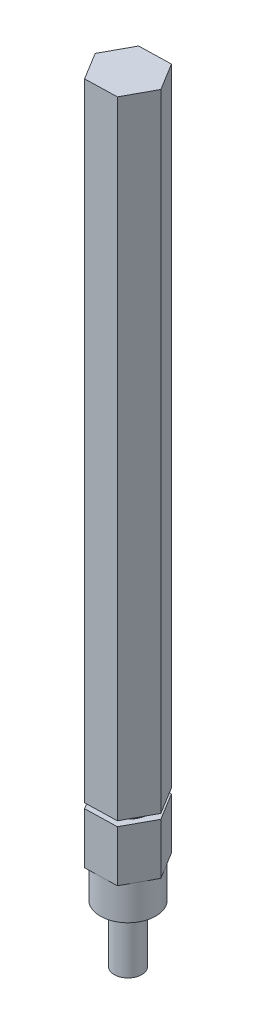
ISO-10303-21;
HEADER;
FILE_DESCRIPTION(('STEP AP214'),'2;1');
FILE_NAME('part.step','',(''),(''),'','','');
FILE_SCHEMA(('AUTOMOTIVE_DESIGN { 1 0 10303 214 1 1 1 1 }'));
ENDSEC;
DATA;
#1=APPLICATION_CONTEXT('core data for automotive mechanical design processes');
#2=APPLICATION_PROTOCOL_DEFINITION('international standard','automotive_design',2000,#1);
#3=PRODUCT_CONTEXT('',#1,'mechanical');
#4=PRODUCT('Part','Part','',(#3));
#5=PRODUCT_RELATED_PRODUCT_CATEGORY('part','',(#4));
#6=PRODUCT_DEFINITION_FORMATION('','',#4);
#7=PRODUCT_DEFINITION_CONTEXT('part definition',#1,'design');
#8=PRODUCT_DEFINITION('design','',#6,#7);
#9=PRODUCT_DEFINITION_SHAPE('','',#8);
#10=(LENGTH_UNIT() NAMED_UNIT(*) SI_UNIT(.MILLI.,.METRE.));
#11=(NAMED_UNIT(*) PLANE_ANGLE_UNIT() SI_UNIT($,.RADIAN.));
#12=(NAMED_UNIT(*) SI_UNIT($,.STERADIAN.) SOLID_ANGLE_UNIT());
#13=UNCERTAINTY_MEASURE_WITH_UNIT(LENGTH_MEASURE(1.E-05),#10,'distance_accuracy_value','');
#14=(GEOMETRIC_REPRESENTATION_CONTEXT(3) GLOBAL_UNCERTAINTY_ASSIGNED_CONTEXT((#13)) GLOBAL_UNIT_ASSIGNED_CONTEXT((#10,
#11,#12)) REPRESENTATION_CONTEXT('',''));
#15=CARTESIAN_POINT('',(0.,0.,0.));
#16=DIRECTION('',(0.,0.,1.));
#17=DIRECTION('',(1.,0.,0.));
#18=AXIS2_PLACEMENT_3D('',#15,#16,#17);
#19=CARTESIAN_POINT('',(0.,13.208,0.));
#20=DIRECTION('',(0.,-1.,0.));
#21=DIRECTION('',(0.,0.,-1.));
#22=AXIS2_PLACEMENT_3D('',#19,#20,#21);
#23=CYLINDRICAL_SURFACE('',#22,3.1496);
#24=CARTESIAN_POINT('',(0.,13.208,0.));
#25=DIRECTION('',(0.,1.,0.));
#26=DIRECTION('',(0.,0.,1.));
#27=AXIS2_PLACEMENT_3D('',#24,#25,#26);
#28=CIRCLE('',#27,3.1496);
#29=CARTESIAN_POINT('',(0.,13.208,3.1496));
#30=VERTEX_POINT('',#29);
#31=EDGE_CURVE('E11',#30,#30,#28,.T.);
#32=ORIENTED_EDGE('',*,*,#31,.F.);
#33=EDGE_LOOP('',(#32));
#34=FACE_BOUND('',#33,.T.);
#35=CARTESIAN_POINT('',(0.,0.,0.));
#36=DIRECTION('',(0.,1.,0.));
#37=DIRECTION('',(0.,0.,1.));
#38=AXIS2_PLACEMENT_3D('',#35,#36,#37);
#39=CIRCLE('',#38,3.1496);
#40=CARTESIAN_POINT('',(0.,0.,3.1496));
#41=VERTEX_POINT('',#40);
#42=EDGE_CURVE('E38',#41,#41,#39,.T.);
#43=ORIENTED_EDGE('',*,*,#42,.T.);
#44=EDGE_LOOP('',(#43));
#45=FACE_BOUND('',#44,.T.);
#46=ADVANCED_FACE('F35',(#34,#45),#23,.T.);
#47=CARTESIAN_POINT('',(0.,0.,0.));
#48=DIRECTION('',(0.,1.,0.));
#49=DIRECTION('',(0.,0.,1.));
#50=AXIS2_PLACEMENT_3D('',#47,#48,#49);
#51=PLANE('',#50);
#52=ORIENTED_EDGE('',*,*,#42,.F.);
#53=EDGE_LOOP('',(#52));
#54=FACE_BOUND('',#53,.T.);
#55=ADVANCED_FACE('F274',(#54),#51,.F.);
#56=CARTESIAN_POINT('',(0.,21.0947,0.));
#57=DIRECTION('',(0.,-1.,0.));
#58=DIRECTION('',(0.,0.,-1.));
#59=AXIS2_PLACEMENT_3D('',#56,#57,#58);
#60=CYLINDRICAL_SURFACE('',#59,6.35);
#61=CARTESIAN_POINT('',(0.,21.0947,0.));
#62=DIRECTION('',(0.,1.,0.));
#63=DIRECTION('',(0.,0.,1.));
#64=AXIS2_PLACEMENT_3D('',#61,#62,#63);
#65=CIRCLE('',#64,6.35);
#66=CARTESIAN_POINT('',(0.16365762984017,21.0947,6.34789068747998));
#67=VERTEX_POINT('',#66);
#68=CARTESIAN_POINT('',(5.57926341072441,21.0947,3.03221367877525));
#69=VERTEX_POINT('',#68);
#70=EDGE_CURVE('E231',#67,#69,#65,.T.);
#71=ORIENTED_EDGE('',*,*,#70,.F.);
#72=CARTESIAN_POINT('',(-5.41560578088425,21.0947,3.31567700870473));
#73=VERTEX_POINT('',#72);
#74=EDGE_CURVE('E49',#73,#67,#65,.T.);
#75=ORIENTED_EDGE('',*,*,#74,.F.);
#76=CARTESIAN_POINT('',(-5.57926341072442,21.0947,-3.03221367877526));
#77=VERTEX_POINT('',#76);
#78=EDGE_CURVE('E53',#77,#73,#65,.T.);
#79=ORIENTED_EDGE('',*,*,#78,.F.);
#80=CARTESIAN_POINT('',(-0.163657629840172,21.0947,-6.34789068747999));
#81=VERTEX_POINT('',#80);
#82=EDGE_CURVE('E242',#81,#77,#65,.T.);
#83=ORIENTED_EDGE('',*,*,#82,.F.);
#84=CARTESIAN_POINT('',(5.41560578088425,21.0947,-3.31567700870473));
#85=VERTEX_POINT('',#84);
#86=EDGE_CURVE('E246',#85,#81,#65,.T.);
#87=ORIENTED_EDGE('',*,*,#86,.F.);
#88=EDGE_CURVE('E234',#69,#85,#65,.T.);
#89=ORIENTED_EDGE('',*,*,#88,.F.);
#90=EDGE_LOOP('',(#71,#75,#79,#83,#87,#89));
#91=FACE_BOUND('',#90,.T.);
#92=CARTESIAN_POINT('',(0.,13.208,0.));
#93=DIRECTION('',(0.,1.,0.));
#94=DIRECTION('',(0.,0.,1.));
#95=AXIS2_PLACEMENT_3D('',#92,#93,#94);
#96=CIRCLE('',#95,6.35);
#97=CARTESIAN_POINT('',(0.,13.208,6.35));
#98=VERTEX_POINT('',#97);
#99=EDGE_CURVE('E230',#98,#98,#96,.T.);
#100=ORIENTED_EDGE('',*,*,#99,.T.);
#101=EDGE_LOOP('',(#100));
#102=FACE_BOUND('',#101,.T.);
#103=ADVANCED_FACE('F271',(#91,#102),#60,.T.);
#104=CARTESIAN_POINT('',(0.,13.208,0.));
#105=DIRECTION('',(0.,1.,0.));
#106=DIRECTION('',(0.,0.,1.));
#107=AXIS2_PLACEMENT_3D('',#104,#105,#106);
#108=PLANE('',#107);
#109=ORIENTED_EDGE('',*,*,#31,.T.);
#110=EDGE_LOOP('',(#109));
#111=FACE_BOUND('',#110,.T.);
#112=ORIENTED_EDGE('',*,*,#99,.F.);
#113=EDGE_LOOP('',(#112));
#114=FACE_BOUND('',#113,.T.);
#115=ADVANCED_FACE('F273',(#111,#114),#108,.F.);
#116=CARTESIAN_POINT('',(0.,21.0947,0.));
#117=DIRECTION('',(0.,1.,0.));
#118=DIRECTION('',(0.,0.,1.));
#119=AXIS2_PLACEMENT_3D('',#116,#117,#118);
#120=PLANE('',#119);
#121=DIRECTION('',(0.999667824799997,0.,-0.0257728550929402));
#122=VECTOR('',#121,1.);
#123=CARTESIAN_POINT('',(-3.50129876736272,21.0947,6.44237846412314));
#124=LINE('',#123,#122);
#125=CARTESIAN_POINT('',(3.82861402704306,21.0947,6.25340291083682));
#126=VERTEX_POINT('',#125);
#127=EDGE_CURVE('E174',#67,#126,#124,.T.);
#128=ORIENTED_EDGE('',*,*,#127,.F.);
#129=ORIENTED_EDGE('',*,*,#70,.T.);
#130=DIRECTION('',(0.477513965161457,0.,-0.878624159169199));
#131=VECTOR('',#130,1.);
#132=CARTESIAN_POINT('',(3.82861402704306,21.0947,6.25340291083682));
#133=LINE('',#132,#131);
#134=EDGE_CURVE('E195',#126,#69,#133,.T.);
#135=ORIENTED_EDGE('',*,*,#134,.F.);
#136=EDGE_LOOP('',(#128,#129,#135));
#137=FACE_BOUND('',#136,.T.);
#138=ADVANCED_FACE('F270',(#137),#120,.F.);
#139=CARTESIAN_POINT('',(7.32991279440578,21.0947,-0.188975553286322));
#140=VERTEX_POINT('',#139);
#141=EDGE_CURVE('E194',#69,#140,#133,.T.);
#142=ORIENTED_EDGE('',*,*,#141,.F.);
#143=ORIENTED_EDGE('',*,*,#88,.T.);
#144=DIRECTION('',(-0.52215385963854,0.,-0.852851304076259));
#145=VECTOR('',#144,1.);
#146=CARTESIAN_POINT('',(7.32991279440578,21.0947,-0.188975553286322));
#147=LINE('',#146,#145);
#148=EDGE_CURVE('E199',#140,#85,#147,.T.);
#149=ORIENTED_EDGE('',*,*,#148,.F.);
#150=EDGE_LOOP('',(#142,#143,#149));
#151=FACE_BOUND('',#150,.T.);
#152=ADVANCED_FACE('F258',(#151),#120,.F.);
#153=CARTESIAN_POINT('',(3.50129876736272,21.0947,-6.44237846412315));
#154=VERTEX_POINT('',#153);
#155=EDGE_CURVE('E198',#85,#154,#147,.T.);
#156=ORIENTED_EDGE('',*,*,#155,.F.);
#157=ORIENTED_EDGE('',*,*,#86,.T.);
#158=DIRECTION('',(-0.999667824799997,0.,0.0257728550929404));
#159=VECTOR('',#158,1.);
#160=CARTESIAN_POINT('',(3.50129876736272,21.0947,-6.44237846412315));
#161=LINE('',#160,#159);
#162=EDGE_CURVE('E203',#154,#81,#161,.T.);
#163=ORIENTED_EDGE('',*,*,#162,.F.);
#164=EDGE_LOOP('',(#156,#157,#163));
#165=FACE_BOUND('',#164,.T.);
#166=ADVANCED_FACE('F259',(#165),#120,.F.);
#167=CARTESIAN_POINT('',(-3.82861402704306,21.0947,-6.25340291083683));
#168=VERTEX_POINT('',#167);
#169=EDGE_CURVE('E202',#81,#168,#161,.T.);
#170=ORIENTED_EDGE('',*,*,#169,.F.);
#171=ORIENTED_EDGE('',*,*,#82,.T.);
#172=DIRECTION('',(-0.477513965161458,0.,0.878624159169199));
#173=VECTOR('',#172,1.);
#174=CARTESIAN_POINT('',(-3.82861402704306,21.0947,-6.25340291083683));
#175=LINE('',#174,#173);
#176=EDGE_CURVE('E207',#168,#77,#175,.T.);
#177=ORIENTED_EDGE('',*,*,#176,.F.);
#178=EDGE_LOOP('',(#170,#171,#177));
#179=FACE_BOUND('',#178,.T.);
#180=ADVANCED_FACE('F331',(#179),#120,.F.);
#181=CARTESIAN_POINT('',(-7.32991279440578,21.0947,0.188975553286315));
#182=VERTEX_POINT('',#181);
#183=EDGE_CURVE('E206',#77,#182,#175,.T.);
#184=ORIENTED_EDGE('',*,*,#183,.F.);
#185=ORIENTED_EDGE('',*,*,#78,.T.);
#186=DIRECTION('',(0.52215385963854,0.,0.852851304076259));
#187=VECTOR('',#186,1.);
#188=CARTESIAN_POINT('',(-7.32991279440578,21.0947,0.188975553286315));
#189=LINE('',#188,#187);
#190=EDGE_CURVE('E180',#182,#73,#189,.T.);
#191=ORIENTED_EDGE('',*,*,#190,.F.);
#192=EDGE_LOOP('',(#184,#185,#191));
#193=FACE_BOUND('',#192,.T.);
#194=ADVANCED_FACE('F339',(#193),#120,.F.);
#195=CARTESIAN_POINT('',(-3.50129876736272,21.0947,6.44237846412314));
#196=VERTEX_POINT('',#195);
#197=EDGE_CURVE('E210',#73,#196,#189,.T.);
#198=ORIENTED_EDGE('',*,*,#197,.F.);
#199=ORIENTED_EDGE('',*,*,#74,.T.);
#200=EDGE_CURVE('E191',#196,#67,#124,.T.);
#201=ORIENTED_EDGE('',*,*,#200,.F.);
#202=EDGE_LOOP('',(#198,#199,#201));
#203=FACE_BOUND('',#202,.T.);
#204=ADVANCED_FACE('F316',(#203),#120,.F.);
#205=CARTESIAN_POINT('',(-3.50129876736272,32.8041,6.44237846412314));
#206=DIRECTION('',(-0.0257728550929402,0.,-0.999667824799997));
#207=DIRECTION('',(-0.999667824799997,0.,0.0257728550929402));
#208=AXIS2_PLACEMENT_3D('',#205,#206,#207);
#209=PLANE('',#208);
#210=ORIENTED_EDGE('',*,*,#200,.T.);
#211=ORIENTED_EDGE('',*,*,#127,.T.);
#212=DIRECTION('',(0.,-1.,0.));
#213=VECTOR('',#212,1.);
#214=CARTESIAN_POINT('',(3.82861402704306,32.8041,6.25340291083682));
#215=LINE('',#214,#213);
#216=CARTESIAN_POINT('',(3.82861402704306,32.8041,6.25340291083682));
#217=VERTEX_POINT('',#216);
#218=EDGE_CURVE('E227',#217,#126,#215,.T.);
#219=ORIENTED_EDGE('',*,*,#218,.F.);
#220=DIRECTION('',(0.999667824799997,0.,-0.0257728550929402));
#221=VECTOR('',#220,1.);
#222=CARTESIAN_POINT('',(-3.50129876736272,32.8041,6.44237846412314));
#223=LINE('',#222,#221);
#224=CARTESIAN_POINT('',(-3.50129876736272,32.8041,6.44237846412314));
#225=VERTEX_POINT('',#224);
#226=EDGE_CURVE('E176',#225,#217,#223,.T.);
#227=ORIENTED_EDGE('',*,*,#226,.F.);
#228=DIRECTION('',(0.,-1.,0.));
#229=VECTOR('',#228,1.);
#230=CARTESIAN_POINT('',(-3.50129876736272,32.8041,6.44237846412314));
#231=LINE('',#230,#229);
#232=EDGE_CURVE('E190',#225,#196,#231,.T.);
#233=ORIENTED_EDGE('',*,*,#232,.T.);
#234=EDGE_LOOP('',(#210,#211,#219,#227,#233));
#235=FACE_BOUND('',#234,.T.);
#236=ADVANCED_FACE('F354',(#235),#209,.F.);
#237=CARTESIAN_POINT('',(3.82861402704306,32.8041,6.25340291083682));
#238=DIRECTION('',(-0.878624159169199,0.,-0.477513965161457));
#239=DIRECTION('',(-0.477513965161457,0.,0.8786241591692));
#240=AXIS2_PLACEMENT_3D('',#237,#238,#239);
#241=PLANE('',#240);
#242=ORIENTED_EDGE('',*,*,#134,.T.);
#243=ORIENTED_EDGE('',*,*,#141,.T.);
#244=DIRECTION('',(0.,-1.,0.));
#245=VECTOR('',#244,1.);
#246=CARTESIAN_POINT('',(7.32991279440578,32.8041,-0.188975553286322));
#247=LINE('',#246,#245);
#248=CARTESIAN_POINT('',(7.32991279440578,32.8041,-0.188975553286322));
#249=VERTEX_POINT('',#248);
#250=EDGE_CURVE('E224',#249,#140,#247,.T.);
#251=ORIENTED_EDGE('',*,*,#250,.F.);
#252=DIRECTION('',(0.477513965161457,0.,-0.878624159169199));
#253=VECTOR('',#252,1.);
#254=CARTESIAN_POINT('',(3.82861402704306,32.8041,6.25340291083682));
#255=LINE('',#254,#253);
#256=EDGE_CURVE('E179',#217,#249,#255,.T.);
#257=ORIENTED_EDGE('',*,*,#256,.F.);
#258=ORIENTED_EDGE('',*,*,#218,.T.);
#259=EDGE_LOOP('',(#242,#243,#251,#257,#258));
#260=FACE_BOUND('',#259,.T.);
#261=ADVANCED_FACE('F266',(#260),#241,.F.);
#262=CARTESIAN_POINT('',(7.32991279440578,32.8041,-0.188975553286322));
#263=DIRECTION('',(-0.852851304076259,0.,0.52215385963854));
#264=DIRECTION('',(0.52215385963854,0.,0.852851304076259));
#265=AXIS2_PLACEMENT_3D('',#262,#263,#264);
#266=PLANE('',#265);
#267=ORIENTED_EDGE('',*,*,#148,.T.);
#268=ORIENTED_EDGE('',*,*,#155,.T.);
#269=DIRECTION('',(0.,-1.,0.));
#270=VECTOR('',#269,1.);
#271=CARTESIAN_POINT('',(3.50129876736272,32.8041,-6.44237846412315));
#272=LINE('',#271,#270);
#273=CARTESIAN_POINT('',(3.50129876736272,32.8041,-6.44237846412315));
#274=VERTEX_POINT('',#273);
#275=EDGE_CURVE('E221',#274,#154,#272,.T.);
#276=ORIENTED_EDGE('',*,*,#275,.F.);
#277=DIRECTION('',(-0.52215385963854,0.,-0.852851304076259));
#278=VECTOR('',#277,1.);
#279=CARTESIAN_POINT('',(7.32991279440578,32.8041,-0.188975553286322));
#280=LINE('',#279,#278);
#281=EDGE_CURVE('E182',#249,#274,#280,.T.);
#282=ORIENTED_EDGE('',*,*,#281,.F.);
#283=ORIENTED_EDGE('',*,*,#250,.T.);
#284=EDGE_LOOP('',(#267,#268,#276,#282,#283));
#285=FACE_BOUND('',#284,.T.);
#286=ADVANCED_FACE('F262',(#285),#266,.F.);
#287=CARTESIAN_POINT('',(3.50129876736272,32.8041,-6.44237846412315));
#288=DIRECTION('',(0.0257728550929404,0.,0.999667824799997));
#289=DIRECTION('',(0.999667824799997,0.,-0.0257728550929404));
#290=AXIS2_PLACEMENT_3D('',#287,#288,#289);
#291=PLANE('',#290);
#292=ORIENTED_EDGE('',*,*,#162,.T.);
#293=ORIENTED_EDGE('',*,*,#169,.T.);
#294=DIRECTION('',(0.,-1.,0.));
#295=VECTOR('',#294,1.);
#296=CARTESIAN_POINT('',(-3.82861402704306,32.8041,-6.25340291083683));
#297=LINE('',#296,#295);
#298=CARTESIAN_POINT('',(-3.82861402704306,32.8041,-6.25340291083683));
#299=VERTEX_POINT('',#298);
#300=EDGE_CURVE('E218',#299,#168,#297,.T.);
#301=ORIENTED_EDGE('',*,*,#300,.F.);
#302=DIRECTION('',(-0.999667824799997,0.,0.0257728550929404));
#303=VECTOR('',#302,1.);
#304=CARTESIAN_POINT('',(3.50129876736272,32.8041,-6.44237846412315));
#305=LINE('',#304,#303);
#306=EDGE_CURVE('E184',#274,#299,#305,.T.);
#307=ORIENTED_EDGE('',*,*,#306,.F.);
#308=ORIENTED_EDGE('',*,*,#275,.T.);
#309=EDGE_LOOP('',(#292,#293,#301,#307,#308));
#310=FACE_BOUND('',#309,.T.);
#311=ADVANCED_FACE('F379',(#310),#291,.F.);
#312=CARTESIAN_POINT('',(-3.82861402704306,32.8041,-6.25340291083683));
#313=DIRECTION('',(0.878624159169199,0.,0.477513965161458));
#314=DIRECTION('',(0.477513965161458,0.,-0.878624159169199));
#315=AXIS2_PLACEMENT_3D('',#312,#313,#314);
#316=PLANE('',#315);
#317=ORIENTED_EDGE('',*,*,#176,.T.);
#318=ORIENTED_EDGE('',*,*,#183,.T.);
#319=DIRECTION('',(0.,-1.,0.));
#320=VECTOR('',#319,1.);
#321=CARTESIAN_POINT('',(-7.32991279440578,32.8041,0.188975553286315));
#322=LINE('',#321,#320);
#323=CARTESIAN_POINT('',(-7.32991279440578,32.8041,0.188975553286315));
#324=VERTEX_POINT('',#323);
#325=EDGE_CURVE('E215',#324,#182,#322,.T.);
#326=ORIENTED_EDGE('',*,*,#325,.F.);
#327=DIRECTION('',(-0.477513965161458,0.,0.878624159169199));
#328=VECTOR('',#327,1.);
#329=CARTESIAN_POINT('',(-3.82861402704306,32.8041,-6.25340291083683));
#330=LINE('',#329,#328);
#331=EDGE_CURVE('E186',#299,#324,#330,.T.);
#332=ORIENTED_EDGE('',*,*,#331,.F.);
#333=ORIENTED_EDGE('',*,*,#300,.T.);
#334=EDGE_LOOP('',(#317,#318,#326,#332,#333));
#335=FACE_BOUND('',#334,.T.);
#336=ADVANCED_FACE('F388',(#335),#316,.F.);
#337=CARTESIAN_POINT('',(-7.32991279440578,32.8041,0.188975553286315));
#338=DIRECTION('',(0.852851304076259,0.,-0.52215385963854));
#339=DIRECTION('',(-0.52215385963854,0.,-0.852851304076259));
#340=AXIS2_PLACEMENT_3D('',#337,#338,#339);
#341=PLANE('',#340);
#342=ORIENTED_EDGE('',*,*,#190,.T.);
#343=ORIENTED_EDGE('',*,*,#197,.T.);
#344=ORIENTED_EDGE('',*,*,#232,.F.);
#345=DIRECTION('',(0.52215385963854,0.,0.852851304076259));
#346=VECTOR('',#345,1.);
#347=CARTESIAN_POINT('',(-7.32991279440578,32.8041,0.188975553286315));
#348=LINE('',#347,#346);
#349=EDGE_CURVE('E188',#324,#225,#348,.T.);
#350=ORIENTED_EDGE('',*,*,#349,.F.);
#351=ORIENTED_EDGE('',*,*,#325,.T.);
#352=EDGE_LOOP('',(#342,#343,#344,#350,#351));
#353=FACE_BOUND('',#352,.T.);
#354=ADVANCED_FACE('F398',(#353),#341,.F.);
#355=CARTESIAN_POINT('',(0.,32.8041,0.));
#356=DIRECTION('',(0.,1.,0.));
#357=DIRECTION('',(0.,0.,1.));
#358=AXIS2_PLACEMENT_3D('',#355,#356,#357);
#359=PLANE('',#358);
#360=CARTESIAN_POINT('',(0.,32.8041,0.));
#361=DIRECTION('',(0.,1.,0.));
#362=DIRECTION('',(0.,0.,1.));
#363=AXIS2_PLACEMENT_3D('',#360,#361,#362);
#364=CIRCLE('',#363,5.0292);
#365=CARTESIAN_POINT('',(0.,32.8041,5.0292));
#366=VERTEX_POINT('',#365);
#367=EDGE_CURVE('E164',#366,#366,#364,.T.);
#368=ORIENTED_EDGE('',*,*,#367,.F.);
#369=EDGE_LOOP('',(#368));
#370=FACE_BOUND('',#369,.T.);
#371=ORIENTED_EDGE('',*,*,#226,.T.);
#372=ORIENTED_EDGE('',*,*,#256,.T.);
#373=ORIENTED_EDGE('',*,*,#281,.T.);
#374=ORIENTED_EDGE('',*,*,#306,.T.);
#375=ORIENTED_EDGE('',*,*,#331,.T.);
#376=ORIENTED_EDGE('',*,*,#349,.T.);
#377=EDGE_LOOP('',(#371,#372,#373,#374,#375,#376));
#378=FACE_BOUND('',#377,.T.);
#379=ADVANCED_FACE('F408',(#370,#378),#359,.T.);
#380=CARTESIAN_POINT('',(0.,33.9725,0.));
#381=DIRECTION('',(0.,-1.,0.));
#382=DIRECTION('',(0.,0.,-1.));
#383=AXIS2_PLACEMENT_3D('',#380,#381,#382);
#384=CYLINDRICAL_SURFACE('',#383,5.0292);
#385=CARTESIAN_POINT('',(0.,33.9725,0.));
#386=DIRECTION('',(0.,1.,0.));
#387=DIRECTION('',(0.,0.,1.));
#388=AXIS2_PLACEMENT_3D('',#385,#386,#387);
#389=CIRCLE('',#388,5.0292);
#390=CARTESIAN_POINT('',(0.,33.9725,5.0292));
#391=VERTEX_POINT('',#390);
#392=EDGE_CURVE('E167',#391,#391,#389,.T.);
#393=ORIENTED_EDGE('',*,*,#392,.F.);
#394=EDGE_LOOP('',(#393));
#395=FACE_BOUND('',#394,.T.);
#396=ORIENTED_EDGE('',*,*,#367,.T.);
#397=EDGE_LOOP('',(#396));
#398=FACE_BOUND('',#397,.T.);
#399=ADVANCED_FACE('F418',(#395,#398),#384,.T.);
#400=CARTESIAN_POINT('',(3.50129876736272,177.4825,-6.44237846412315));
#401=DIRECTION('',(0.0257728550929404,0.,0.999667824799997));
#402=DIRECTION('',(0.999667824799997,0.,-0.0257728550929404));
#403=AXIS2_PLACEMENT_3D('',#400,#401,#402);
#404=PLANE('',#403);
#405=DIRECTION('',(-0.999667824799997,0.,0.0257728550929404));
#406=VECTOR('',#405,1.);
#407=CARTESIAN_POINT('',(3.50129876736272,33.9725,-6.44237846412315));
#408=LINE('',#407,#406);
#409=CARTESIAN_POINT('',(3.50129876736272,33.9725,-6.44237846412315));
#410=VERTEX_POINT('',#409);
#411=CARTESIAN_POINT('',(-3.82861402704306,33.9725,-6.25340291083683));
#412=VERTEX_POINT('',#411);
#413=EDGE_CURVE('E163',#410,#412,#408,.T.);
#414=ORIENTED_EDGE('',*,*,#413,.T.);
#415=DIRECTION('',(0.,-1.,0.));
#416=VECTOR('',#415,1.);
#417=CARTESIAN_POINT('',(-3.82861402704306,177.4825,-6.25340291083683));
#418=LINE('',#417,#416);
#419=CARTESIAN_POINT('',(-3.82861402704306,177.4825,-6.25340291083683));
#420=VERTEX_POINT('',#419);
#421=EDGE_CURVE('E143',#420,#412,#418,.T.);
#422=ORIENTED_EDGE('',*,*,#421,.F.);
#423=DIRECTION('',(-0.999667824799997,0.,0.0257728550929404));
#424=VECTOR('',#423,1.);
#425=CARTESIAN_POINT('',(3.50129876736272,177.4825,-6.44237846412315));
#426=LINE('',#425,#424);
#427=CARTESIAN_POINT('',(3.50129876736272,177.4825,-6.44237846412315));
#428=VERTEX_POINT('',#427);
#429=EDGE_CURVE('E150',#428,#420,#426,.T.);
#430=ORIENTED_EDGE('',*,*,#429,.F.);
#431=DIRECTION('',(0.,-1.,0.));
#432=VECTOR('',#431,1.);
#433=CARTESIAN_POINT('',(3.50129876736272,177.4825,-6.44237846412315));
#434=LINE('',#433,#432);
#435=EDGE_CURVE('E524',#428,#410,#434,.T.);
#436=ORIENTED_EDGE('',*,*,#435,.T.);
#437=EDGE_LOOP('',(#414,#422,#430,#436));
#438=FACE_BOUND('',#437,.T.);
#439=ADVANCED_FACE('F161',(#438),#404,.F.);
#440=CARTESIAN_POINT('',(-3.82861402704306,177.4825,-6.25340291083683));
#441=DIRECTION('',(0.878624159169199,0.,0.477513965161457));
#442=DIRECTION('',(0.477513965161458,0.,-0.878624159169199));
#443=AXIS2_PLACEMENT_3D('',#440,#441,#442);
#444=PLANE('',#443);
#445=DIRECTION('',(-0.477513965161458,0.,0.878624159169199));
#446=VECTOR('',#445,1.);
#447=CARTESIAN_POINT('',(-3.82861402704306,33.9725,-6.25340291083683));
#448=LINE('',#447,#446);
#449=CARTESIAN_POINT('',(-7.32991279440578,33.9725,0.188975553286315));
#450=VERTEX_POINT('',#449);
#451=EDGE_CURVE('E511',#412,#450,#448,.T.);
#452=ORIENTED_EDGE('',*,*,#451,.T.);
#453=DIRECTION('',(0.,-1.,0.));
#454=VECTOR('',#453,1.);
#455=CARTESIAN_POINT('',(-7.32991279440578,177.4825,0.188975553286315));
#456=LINE('',#455,#454);
#457=CARTESIAN_POINT('',(-7.32991279440578,177.4825,0.188975553286315));
#458=VERTEX_POINT('',#457);
#459=EDGE_CURVE('E146',#458,#450,#456,.T.);
#460=ORIENTED_EDGE('',*,*,#459,.F.);
#461=DIRECTION('',(-0.477513965161458,0.,0.878624159169199));
#462=VECTOR('',#461,1.);
#463=CARTESIAN_POINT('',(-3.82861402704306,177.4825,-6.25340291083683));
#464=LINE('',#463,#462);
#465=EDGE_CURVE('E139',#420,#458,#464,.T.);
#466=ORIENTED_EDGE('',*,*,#465,.F.);
#467=ORIENTED_EDGE('',*,*,#421,.T.);
#468=EDGE_LOOP('',(#452,#460,#466,#467));
#469=FACE_BOUND('',#468,.T.);
#470=ADVANCED_FACE('F141',(#469),#444,.F.);
#471=CARTESIAN_POINT('',(-7.32991279440578,177.4825,0.188975553286315));
#472=DIRECTION('',(0.852851304076259,0.,-0.52215385963854));
#473=DIRECTION('',(-0.52215385963854,0.,-0.852851304076259));
#474=AXIS2_PLACEMENT_3D('',#471,#472,#473);
#475=PLANE('',#474);
#476=DIRECTION('',(0.52215385963854,0.,0.852851304076259));
#477=VECTOR('',#476,1.);
#478=CARTESIAN_POINT('',(-7.32991279440578,33.9725,0.188975553286315));
#479=LINE('',#478,#477);
#480=CARTESIAN_POINT('',(-3.50129876736272,33.9725,6.44237846412314));
#481=VERTEX_POINT('',#480);
#482=EDGE_CURVE('E513',#450,#481,#479,.T.);
#483=ORIENTED_EDGE('',*,*,#482,.T.);
#484=DIRECTION('',(0.,-1.,0.));
#485=VECTOR('',#484,1.);
#486=CARTESIAN_POINT('',(-3.50129876736272,177.4825,6.44237846412314));
#487=LINE('',#486,#485);
#488=CARTESIAN_POINT('',(-3.50129876736272,177.4825,6.44237846412314));
#489=VERTEX_POINT('',#488);
#490=EDGE_CURVE('E169',#489,#481,#487,.T.);
#491=ORIENTED_EDGE('',*,*,#490,.F.);
#492=DIRECTION('',(0.52215385963854,0.,0.852851304076259));
#493=VECTOR('',#492,1.);
#494=CARTESIAN_POINT('',(-7.32991279440578,177.4825,0.188975553286315));
#495=LINE('',#494,#493);
#496=EDGE_CURVE('E149',#458,#489,#495,.T.);
#497=ORIENTED_EDGE('',*,*,#496,.F.);
#498=ORIENTED_EDGE('',*,*,#459,.T.);
#499=EDGE_LOOP('',(#483,#491,#497,#498));
#500=FACE_BOUND('',#499,.T.);
#501=ADVANCED_FACE('F445',(#500),#475,.F.);
#502=CARTESIAN_POINT('',(-3.50129876736272,177.4825,6.44237846412314));
#503=DIRECTION('',(-0.0257728550929402,0.,-0.999667824799997));
#504=DIRECTION('',(-0.999667824799997,0.,0.0257728550929402));
#505=AXIS2_PLACEMENT_3D('',#502,#503,#504);
#506=PLANE('',#505);
#507=DIRECTION('',(0.999667824799997,0.,-0.0257728550929402));
#508=VECTOR('',#507,1.);
#509=CARTESIAN_POINT('',(-3.50129876736272,33.9725,6.44237846412314));
#510=LINE('',#509,#508);
#511=CARTESIAN_POINT('',(3.82861402704306,33.9725,6.25340291083682));
#512=VERTEX_POINT('',#511);
#513=EDGE_CURVE('E519',#481,#512,#510,.T.);
#514=ORIENTED_EDGE('',*,*,#513,.T.);
#515=DIRECTION('',(0.,-1.,0.));
#516=VECTOR('',#515,1.);
#517=CARTESIAN_POINT('',(3.82861402704306,177.4825,6.25340291083682));
#518=LINE('',#517,#516);
#519=CARTESIAN_POINT('',(3.82861402704306,177.4825,6.25340291083682));
#520=VERTEX_POINT('',#519);
#521=EDGE_CURVE('E529',#520,#512,#518,.T.);
#522=ORIENTED_EDGE('',*,*,#521,.F.);
#523=DIRECTION('',(0.999667824799997,0.,-0.0257728550929402));
#524=VECTOR('',#523,1.);
#525=CARTESIAN_POINT('',(-3.50129876736272,177.4825,6.44237846412314));
#526=LINE('',#525,#524);
#527=EDGE_CURVE('E536',#489,#520,#526,.T.);
#528=ORIENTED_EDGE('',*,*,#527,.F.);
#529=ORIENTED_EDGE('',*,*,#490,.T.);
#530=EDGE_LOOP('',(#514,#522,#528,#529));
#531=FACE_BOUND('',#530,.T.);
#532=ADVANCED_FACE('F454',(#531),#506,.F.);
#533=CARTESIAN_POINT('',(3.82861402704306,177.4825,6.25340291083682));
#534=DIRECTION('',(-0.878624159169199,0.,-0.477513965161457));
#535=DIRECTION('',(-0.477513965161457,0.,0.8786241591692));
#536=AXIS2_PLACEMENT_3D('',#533,#534,#535);
#537=PLANE('',#536);
#538=DIRECTION('',(0.477513965161457,0.,-0.878624159169199));
#539=VECTOR('',#538,1.);
#540=CARTESIAN_POINT('',(3.82861402704306,33.9725,6.25340291083682));
#541=LINE('',#540,#539);
#542=CARTESIAN_POINT('',(7.32991279440578,33.9725,-0.188975553286322));
#543=VERTEX_POINT('',#542);
#544=EDGE_CURVE('E521',#512,#543,#541,.T.);
#545=ORIENTED_EDGE('',*,*,#544,.T.);
#546=DIRECTION('',(0.,-1.,0.));
#547=VECTOR('',#546,1.);
#548=CARTESIAN_POINT('',(7.32991279440578,177.4825,-0.188975553286322));
#549=LINE('',#548,#547);
#550=CARTESIAN_POINT('',(7.32991279440578,177.4825,-0.188975553286322));
#551=VERTEX_POINT('',#550);
#552=EDGE_CURVE('E526',#551,#543,#549,.T.);
#553=ORIENTED_EDGE('',*,*,#552,.F.);
#554=DIRECTION('',(0.477513965161457,0.,-0.878624159169199));
#555=VECTOR('',#554,1.);
#556=CARTESIAN_POINT('',(3.82861402704306,177.4825,6.25340291083682));
#557=LINE('',#556,#555);
#558=EDGE_CURVE('E539',#520,#551,#557,.T.);
#559=ORIENTED_EDGE('',*,*,#558,.F.);
#560=ORIENTED_EDGE('',*,*,#521,.T.);
#561=EDGE_LOOP('',(#545,#553,#559,#560));
#562=FACE_BOUND('',#561,.T.);
#563=ADVANCED_FACE('F464',(#562),#537,.F.);
#564=CARTESIAN_POINT('',(7.32991279440578,177.4825,-0.188975553286322));
#565=DIRECTION('',(-0.852851304076259,0.,0.52215385963854));
#566=DIRECTION('',(0.52215385963854,0.,0.852851304076259));
#567=AXIS2_PLACEMENT_3D('',#564,#565,#566);
#568=PLANE('',#567);
#569=DIRECTION('',(-0.52215385963854,0.,-0.852851304076259));
#570=VECTOR('',#569,1.);
#571=CARTESIAN_POINT('',(7.32991279440578,33.9725,-0.188975553286322));
#572=LINE('',#571,#570);
#573=EDGE_CURVE('E159',#543,#410,#572,.T.);
#574=ORIENTED_EDGE('',*,*,#573,.T.);
#575=ORIENTED_EDGE('',*,*,#435,.F.);
#576=DIRECTION('',(-0.52215385963854,0.,-0.852851304076259));
#577=VECTOR('',#576,1.);
#578=CARTESIAN_POINT('',(7.32991279440578,177.4825,-0.188975553286322));
#579=LINE('',#578,#577);
#580=EDGE_CURVE('E155',#551,#428,#579,.T.);
#581=ORIENTED_EDGE('',*,*,#580,.F.);
#582=ORIENTED_EDGE('',*,*,#552,.T.);
#583=EDGE_LOOP('',(#574,#575,#581,#582));
#584=FACE_BOUND('',#583,.T.);
#585=ADVANCED_FACE('F474',(#584),#568,.F.);
#586=CARTESIAN_POINT('',(0.,177.4825,0.));
#587=DIRECTION('',(0.,1.,0.));
#588=DIRECTION('',(0.,0.,1.));
#589=AXIS2_PLACEMENT_3D('',#586,#587,#588);
#590=PLANE('',#589);
#591=ORIENTED_EDGE('',*,*,#429,.T.);
#592=ORIENTED_EDGE('',*,*,#465,.T.);
#593=ORIENTED_EDGE('',*,*,#496,.T.);
#594=ORIENTED_EDGE('',*,*,#527,.T.);
#595=ORIENTED_EDGE('',*,*,#558,.T.);
#596=ORIENTED_EDGE('',*,*,#580,.T.);
#597=EDGE_LOOP('',(#591,#592,#593,#594,#595,#596));
#598=FACE_BOUND('',#597,.T.);
#599=ADVANCED_FACE('F153',(#598),#590,.T.);
#600=CARTESIAN_POINT('',(0.,33.9725,0.));
#601=DIRECTION('',(0.,1.,0.));
#602=DIRECTION('',(0.,0.,1.));
#603=AXIS2_PLACEMENT_3D('',#600,#601,#602);
#604=PLANE('',#603);
#605=ORIENTED_EDGE('',*,*,#392,.T.);
#606=EDGE_LOOP('',(#605));
#607=FACE_BOUND('',#606,.T.);
#608=ORIENTED_EDGE('',*,*,#413,.F.);
#609=ORIENTED_EDGE('',*,*,#573,.F.);
#610=ORIENTED_EDGE('',*,*,#544,.F.);
#611=ORIENTED_EDGE('',*,*,#513,.F.);
#612=ORIENTED_EDGE('',*,*,#482,.F.);
#613=ORIENTED_EDGE('',*,*,#451,.F.);
#614=EDGE_LOOP('',(#608,#609,#610,#611,#612,#613));
#615=FACE_BOUND('',#614,.T.);
#616=ADVANCED_FACE('F493',(#607,#615),#604,.F.);
#617=CLOSED_SHELL('',(#46,#55,#103,#115,#138,#152,#166,#180,#194,#204,#236,#261,#286,#311,#336,
#354,#379,#399,#439,#470,#501,#532,#563,#585,#599,#616));
#618=MANIFOLD_SOLID_BREP('B2',#617);
#619=ADVANCED_BREP_SHAPE_REPRESENTATION('',(#18,#618),#14);
#620=SHAPE_DEFINITION_REPRESENTATION(#9,#619);
ENDSEC;
END-ISO-10303-21;
